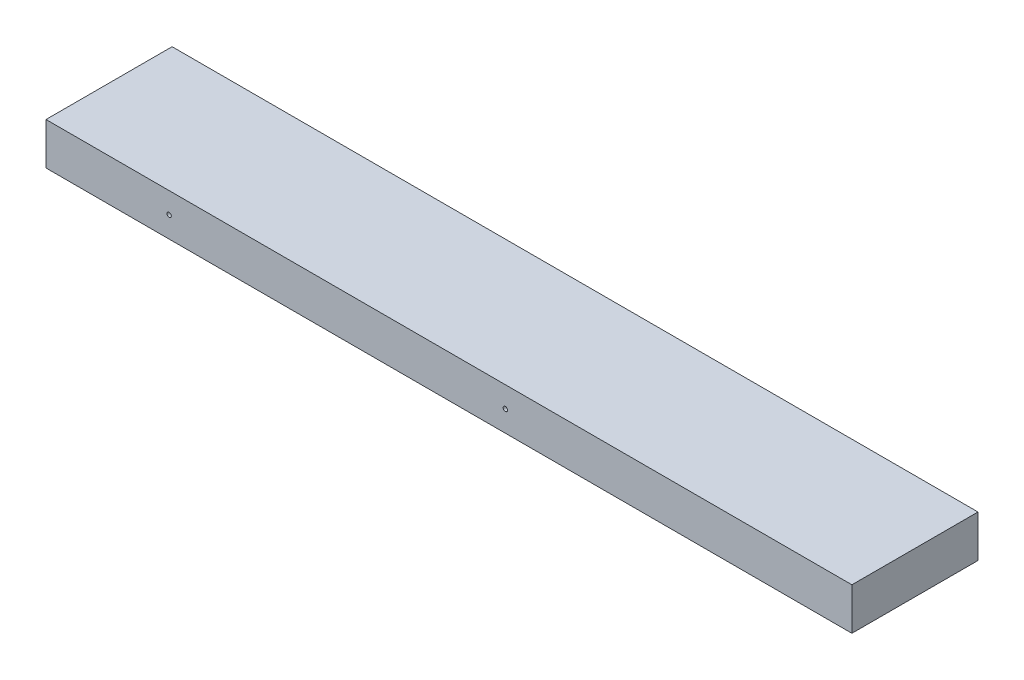
ISO-10303-21;
HEADER;
FILE_DESCRIPTION(('STEP AP214'),'2;1');
FILE_NAME('part.step','',(''),(''),'','','');
FILE_SCHEMA(('AUTOMOTIVE_DESIGN { 1 0 10303 214 1 1 1 1 }'));
ENDSEC;
DATA;
#1=APPLICATION_CONTEXT('core data for automotive mechanical design processes');
#2=APPLICATION_PROTOCOL_DEFINITION('international standard','automotive_design',2000,#1);
#3=PRODUCT_CONTEXT('',#1,'mechanical');
#4=PRODUCT('Part','Part','',(#3));
#5=PRODUCT_RELATED_PRODUCT_CATEGORY('part','',(#4));
#6=PRODUCT_DEFINITION_FORMATION('','',#4);
#7=PRODUCT_DEFINITION_CONTEXT('part definition',#1,'design');
#8=PRODUCT_DEFINITION('design','',#6,#7);
#9=PRODUCT_DEFINITION_SHAPE('','',#8);
#10=(LENGTH_UNIT() NAMED_UNIT(*) SI_UNIT(.MILLI.,.METRE.));
#11=(NAMED_UNIT(*) PLANE_ANGLE_UNIT() SI_UNIT($,.RADIAN.));
#12=(NAMED_UNIT(*) SI_UNIT($,.STERADIAN.) SOLID_ANGLE_UNIT());
#13=UNCERTAINTY_MEASURE_WITH_UNIT(LENGTH_MEASURE(1.E-05),#10,'distance_accuracy_value','');
#14=(GEOMETRIC_REPRESENTATION_CONTEXT(3) GLOBAL_UNCERTAINTY_ASSIGNED_CONTEXT((#13)) GLOBAL_UNIT_ASSIGNED_CONTEXT((#10,
#11,#12)) REPRESENTATION_CONTEXT('',''));
#15=CARTESIAN_POINT('',(0.,0.,0.));
#16=DIRECTION('',(0.,0.,1.));
#17=DIRECTION('',(1.,0.,0.));
#18=AXIS2_PLACEMENT_3D('',#15,#16,#17);
#19=CARTESIAN_POINT('',(86.3599999999997,5213.35,2683.51));
#20=DIRECTION('',(0.,-1.,0.));
#21=DIRECTION('',(0.,0.,-1.));
#22=AXIS2_PLACEMENT_3D('',#19,#20,#21);
#23=PLANE('',#22);
#24=DIRECTION('',(1.,0.,0.));
#25=VECTOR('',#24,1.);
#26=CARTESIAN_POINT('',(265.815570864871,5213.35,2683.51));
#27=LINE('',#26,#25);
#28=CARTESIAN_POINT('',(80.0100000000007,5213.35,2683.51));
#29=VERTEX_POINT('',#28);
#30=CARTESIAN_POINT('',(445.271141729743,5213.35000000001,2683.51));
#31=VERTEX_POINT('',#30);
#32=EDGE_CURVE('E71',#29,#31,#27,.T.);
#33=ORIENTED_EDGE('',*,*,#32,.T.);
#34=DIRECTION('',(0.,0.,-1.));
#35=VECTOR('',#34,1.);
#36=CARTESIAN_POINT('',(445.271141729743,5213.35000000001,2683.51));
#37=LINE('',#36,#35);
#38=CARTESIAN_POINT('',(445.271141729743,5213.35,2740.66));
#39=VERTEX_POINT('',#38);
#40=EDGE_CURVE('E146',#39,#31,#37,.T.);
#41=ORIENTED_EDGE('',*,*,#40,.F.);
#42=DIRECTION('',(-1.,0.,0.));
#43=VECTOR('',#42,1.);
#44=CARTESIAN_POINT('',(265.815570864871,5213.35,2740.66));
#45=LINE('',#44,#43);
#46=CARTESIAN_POINT('',(80.0099999999994,5213.35,2740.66));
#47=VERTEX_POINT('',#46);
#48=EDGE_CURVE('E76',#39,#47,#45,.T.);
#49=ORIENTED_EDGE('',*,*,#48,.T.);
#50=DIRECTION('',(0.,0.,1.));
#51=VECTOR('',#50,1.);
#52=CARTESIAN_POINT('',(80.0100000000007,5213.35,2683.51));
#53=LINE('',#52,#51);
#54=EDGE_CURVE('E137',#29,#47,#53,.T.);
#55=ORIENTED_EDGE('',*,*,#54,.F.);
#56=EDGE_LOOP('',(#33,#41,#49,#55));
#57=FACE_BOUND('',#56,.T.);
#58=ADVANCED_FACE('F40',(#57),#23,.T.);
#59=CARTESIAN_POINT('',(265.815570864873,5222.875,2740.66));
#60=DIRECTION('',(0.,0.,-1.));
#61=DIRECTION('',(-1.,0.,0.));
#62=AXIS2_PLACEMENT_3D('',#59,#60,#61);
#63=PLANE('',#62);
#64=CARTESIAN_POINT('',(135.802759022742,5222.875,2740.66));
#65=DIRECTION('',(0.,0.,-1.));
#66=DIRECTION('',(-1.,0.,0.));
#67=AXIS2_PLACEMENT_3D('',#64,#65,#66);
#68=CIRCLE('',#67,0.991870000000006);
#69=CARTESIAN_POINT('',(134.810889022742,5222.875,2740.66));
#70=VERTEX_POINT('',#69);
#71=EDGE_CURVE('E43',#70,#70,#68,.T.);
#72=ORIENTED_EDGE('',*,*,#71,.T.);
#73=EDGE_LOOP('',(#72));
#74=FACE_BOUND('',#73,.T.);
#75=CARTESIAN_POINT('',(288.202759022741,5222.87500000001,2740.66));
#76=DIRECTION('',(0.,0.,-1.));
#77=DIRECTION('',(-1.,0.,0.));
#78=AXIS2_PLACEMENT_3D('',#75,#76,#77);
#79=CIRCLE('',#78,0.991870000000006);
#80=CARTESIAN_POINT('',(287.210889022741,5222.87500000001,2740.66));
#81=VERTEX_POINT('',#80);
#82=EDGE_CURVE('E118',#81,#81,#79,.T.);
#83=ORIENTED_EDGE('',*,*,#82,.T.);
#84=EDGE_LOOP('',(#83));
#85=FACE_BOUND('',#84,.T.);
#86=DIRECTION('',(1.,0.,0.));
#87=VECTOR('',#86,1.);
#88=CARTESIAN_POINT('',(445.271141729742,5232.40000000001,2740.66));
#89=LINE('',#88,#87);
#90=CARTESIAN_POINT('',(80.0100000000003,5232.4,2740.66));
#91=VERTEX_POINT('',#90);
#92=CARTESIAN_POINT('',(445.271141729742,5232.40000000001,2740.66));
#93=VERTEX_POINT('',#92);
#94=EDGE_CURVE('E80',#91,#93,#89,.T.);
#95=ORIENTED_EDGE('',*,*,#94,.F.);
#96=DIRECTION('',(0.,1.,0.));
#97=VECTOR('',#96,1.);
#98=CARTESIAN_POINT('',(80.0099999999994,5213.35,2740.66));
#99=LINE('',#98,#97);
#100=EDGE_CURVE('E139',#47,#91,#99,.T.);
#101=ORIENTED_EDGE('',*,*,#100,.F.);
#102=ORIENTED_EDGE('',*,*,#48,.F.);
#103=DIRECTION('',(0.,1.,0.));
#104=VECTOR('',#103,1.);
#105=CARTESIAN_POINT('',(445.271141729743,5213.35,2740.66));
#106=LINE('',#105,#104);
#107=EDGE_CURVE('E148',#93,#39,#106,.F.);
#108=ORIENTED_EDGE('',*,*,#107,.F.);
#109=EDGE_LOOP('',(#95,#101,#102,#108));
#110=FACE_BOUND('',#109,.T.);
#111=ADVANCED_FACE('F160',(#74,#85,#110),#63,.F.);
#112=CARTESIAN_POINT('',(445.271141729743,5213.35000000001,2683.51));
#113=DIRECTION('',(1.,0.,0.));
#114=DIRECTION('',(0.,0.,-1.));
#115=AXIS2_PLACEMENT_3D('',#112,#113,#114);
#116=PLANE('',#115);
#117=DIRECTION('',(0.,1.,0.));
#118=VECTOR('',#117,1.);
#119=CARTESIAN_POINT('',(445.271141729744,5222.875,2683.51));
#120=LINE('',#119,#118);
#121=CARTESIAN_POINT('',(445.271141729743,5232.40000000001,2683.51));
#122=VERTEX_POINT('',#121);
#123=EDGE_CURVE('E58',#31,#122,#120,.T.);
#124=ORIENTED_EDGE('',*,*,#123,.T.);
#125=DIRECTION('',(0.,0.,1.));
#126=VECTOR('',#125,1.);
#127=CARTESIAN_POINT('',(445.271141729743,5232.40000000001,2683.51));
#128=LINE('',#127,#126);
#129=EDGE_CURVE('E49',#93,#122,#128,.F.);
#130=ORIENTED_EDGE('',*,*,#129,.F.);
#131=ORIENTED_EDGE('',*,*,#107,.T.);
#132=ORIENTED_EDGE('',*,*,#40,.T.);
#133=EDGE_LOOP('',(#124,#130,#131,#132));
#134=FACE_BOUND('',#133,.T.);
#135=ADVANCED_FACE('F191',(#134),#116,.T.);
#136=CARTESIAN_POINT('',(265.815570864873,5222.87500000001,2683.51));
#137=DIRECTION('',(0.,0.,1.));
#138=DIRECTION('',(1.,0.,0.));
#139=AXIS2_PLACEMENT_3D('',#136,#137,#138);
#140=PLANE('',#139);
#141=CARTESIAN_POINT('',(415.202759022741,5222.87500000001,2683.51));
#142=DIRECTION('',(0.,0.,1.));
#143=DIRECTION('',(1.,0.,0.));
#144=AXIS2_PLACEMENT_3D('',#141,#142,#143);
#145=CIRCLE('',#144,0.991870000000006);
#146=CARTESIAN_POINT('',(416.194629022741,5222.87500000001,2683.51));
#147=VERTEX_POINT('',#146);
#148=EDGE_CURVE('E122',#147,#147,#145,.T.);
#149=ORIENTED_EDGE('',*,*,#148,.T.);
#150=EDGE_LOOP('',(#149));
#151=FACE_BOUND('',#150,.T.);
#152=CARTESIAN_POINT('',(313.602759022741,5222.87500000001,2683.51));
#153=DIRECTION('',(0.,0.,1.));
#154=DIRECTION('',(1.,0.,0.));
#155=AXIS2_PLACEMENT_3D('',#152,#153,#154);
#156=CIRCLE('',#155,0.991870000000006);
#157=CARTESIAN_POINT('',(314.594629022741,5222.87500000001,2683.51));
#158=VERTEX_POINT('',#157);
#159=EDGE_CURVE('E126',#158,#158,#156,.T.);
#160=ORIENTED_EDGE('',*,*,#159,.T.);
#161=EDGE_LOOP('',(#160));
#162=FACE_BOUND('',#161,.T.);
#163=CARTESIAN_POINT('',(110.402759022741,5222.87500000001,2683.51));
#164=DIRECTION('',(0.,0.,1.));
#165=DIRECTION('',(1.,0.,0.));
#166=AXIS2_PLACEMENT_3D('',#163,#164,#165);
#167=CIRCLE('',#166,0.991870000000006);
#168=CARTESIAN_POINT('',(111.394629022741,5222.87500000001,2683.51));
#169=VERTEX_POINT('',#168);
#170=EDGE_CURVE('E130',#169,#169,#167,.T.);
#171=ORIENTED_EDGE('',*,*,#170,.T.);
#172=EDGE_LOOP('',(#171));
#173=FACE_BOUND('',#172,.T.);
#174=ORIENTED_EDGE('',*,*,#123,.F.);
#175=ORIENTED_EDGE('',*,*,#32,.F.);
#176=DIRECTION('',(0.,-1.,0.));
#177=VECTOR('',#176,1.);
#178=CARTESIAN_POINT('',(80.0099999999999,5232.4,2683.51));
#179=LINE('',#178,#177);
#180=CARTESIAN_POINT('',(80.0099999999999,5232.4,2683.51));
#181=VERTEX_POINT('',#180);
#182=EDGE_CURVE('E134',#181,#29,#179,.T.);
#183=ORIENTED_EDGE('',*,*,#182,.F.);
#184=DIRECTION('',(1.,0.,0.));
#185=VECTOR('',#184,1.);
#186=CARTESIAN_POINT('',(445.271141729743,5232.40000000001,2683.51));
#187=LINE('',#186,#185);
#188=EDGE_CURVE('E11',#122,#181,#187,.F.);
#189=ORIENTED_EDGE('',*,*,#188,.F.);
#190=EDGE_LOOP('',(#174,#175,#183,#189));
#191=FACE_BOUND('',#190,.T.);
#192=ADVANCED_FACE('F181',(#151,#162,#173,#191),#140,.F.);
#193=CARTESIAN_POINT('',(445.271141729743,5232.40000000001,2683.51));
#194=DIRECTION('',(0.,1.,0.));
#195=DIRECTION('',(0.,0.,1.));
#196=AXIS2_PLACEMENT_3D('',#193,#194,#195);
#197=PLANE('',#196);
#198=ORIENTED_EDGE('',*,*,#188,.T.);
#199=DIRECTION('',(0.,0.,-1.));
#200=VECTOR('',#199,1.);
#201=CARTESIAN_POINT('',(80.0100000000003,5232.4,2740.66));
#202=LINE('',#201,#200);
#203=EDGE_CURVE('E131',#91,#181,#202,.T.);
#204=ORIENTED_EDGE('',*,*,#203,.F.);
#205=ORIENTED_EDGE('',*,*,#94,.T.);
#206=ORIENTED_EDGE('',*,*,#129,.T.);
#207=EDGE_LOOP('',(#198,#204,#205,#206));
#208=FACE_BOUND('',#207,.T.);
#209=ADVANCED_FACE('F178',(#208),#197,.T.);
#210=CARTESIAN_POINT('',(80.0099999999997,1.77635683940025E-12,0.));
#211=DIRECTION('',(-1.,0.,0.));
#212=DIRECTION('',(0.,0.,1.));
#213=AXIS2_PLACEMENT_3D('',#210,#211,#212);
#214=PLANE('',#213);
#215=ORIENTED_EDGE('',*,*,#203,.T.);
#216=ORIENTED_EDGE('',*,*,#182,.T.);
#217=ORIENTED_EDGE('',*,*,#54,.T.);
#218=ORIENTED_EDGE('',*,*,#100,.T.);
#219=EDGE_LOOP('',(#215,#216,#217,#218));
#220=FACE_BOUND('',#219,.T.);
#221=ADVANCED_FACE('F180',(#220),#214,.T.);
#222=CARTESIAN_POINT('',(110.402759022742,5222.87500000001,2664.46));
#223=DIRECTION('',(0.,0.,-1.));
#224=DIRECTION('',(-1.,0.,0.));
#225=AXIS2_PLACEMENT_3D('',#222,#223,#224);
#226=CYLINDRICAL_SURFACE('',#225,0.991870000000006);
#227=CARTESIAN_POINT('',(110.402759022741,5222.87500000001,2702.56));
#228=DIRECTION('',(0.,0.,-1.));
#229=DIRECTION('',(-1.,0.,0.));
#230=AXIS2_PLACEMENT_3D('',#227,#228,#229);
#231=CIRCLE('',#230,0.991870000000006);
#232=CARTESIAN_POINT('',(109.410889022741,5222.87500000001,2702.56));
#233=VERTEX_POINT('',#232);
#234=EDGE_CURVE('E127',#233,#233,#231,.T.);
#235=ORIENTED_EDGE('',*,*,#234,.F.);
#236=EDGE_LOOP('',(#235));
#237=FACE_BOUND('',#236,.T.);
#238=ORIENTED_EDGE('',*,*,#170,.F.);
#239=EDGE_LOOP('',(#238));
#240=FACE_BOUND('',#239,.T.);
#241=ADVANCED_FACE('F188',(#237,#240),#226,.F.);
#242=CARTESIAN_POINT('',(110.402759022741,5222.87500000001,2702.56));
#243=DIRECTION('',(0.,0.,-1.));
#244=DIRECTION('',(-1.,0.,0.));
#245=AXIS2_PLACEMENT_3D('',#242,#243,#244);
#246=CONICAL_SURFACE('',#245,0.991870000000006,1.02974425867677);
#247=CARTESIAN_POINT('',(110.402759022742,5222.875,2703.1559756222));
#248=VERTEX_POINT('',#247);
#249=VERTEX_LOOP('',#248);
#250=FACE_BOUND('',#249,.T.);
#251=ORIENTED_EDGE('',*,*,#234,.T.);
#252=EDGE_LOOP('',(#251));
#253=FACE_BOUND('',#252,.T.);
#254=ADVANCED_FACE('F257',(#250,#253),#246,.F.);
#255=CARTESIAN_POINT('',(313.602759022742,5222.87500000001,2664.46));
#256=DIRECTION('',(0.,0.,-1.));
#257=DIRECTION('',(-1.,0.,0.));
#258=AXIS2_PLACEMENT_3D('',#255,#256,#257);
#259=CYLINDRICAL_SURFACE('',#258,0.991870000000006);
#260=CARTESIAN_POINT('',(313.602759022742,5222.87500000001,2702.56));
#261=DIRECTION('',(0.,0.,-1.));
#262=DIRECTION('',(-1.,0.,0.));
#263=AXIS2_PLACEMENT_3D('',#260,#261,#262);
#264=CIRCLE('',#263,0.991870000000006);
#265=CARTESIAN_POINT('',(312.610889022742,5222.87500000001,2702.56));
#266=VERTEX_POINT('',#265);
#267=EDGE_CURVE('E123',#266,#266,#264,.T.);
#268=ORIENTED_EDGE('',*,*,#267,.F.);
#269=EDGE_LOOP('',(#268));
#270=FACE_BOUND('',#269,.T.);
#271=ORIENTED_EDGE('',*,*,#159,.F.);
#272=EDGE_LOOP('',(#271));
#273=FACE_BOUND('',#272,.T.);
#274=ADVANCED_FACE('F248',(#270,#273),#259,.F.);
#275=CARTESIAN_POINT('',(313.602759022742,5222.87500000001,2702.56));
#276=DIRECTION('',(0.,0.,-1.));
#277=DIRECTION('',(-1.,0.,0.));
#278=AXIS2_PLACEMENT_3D('',#275,#276,#277);
#279=CONICAL_SURFACE('',#278,0.991870000000006,1.02974425867677);
#280=CARTESIAN_POINT('',(313.602759022743,5222.875,2703.1559756222));
#281=VERTEX_POINT('',#280);
#282=VERTEX_LOOP('',#281);
#283=FACE_BOUND('',#282,.T.);
#284=ORIENTED_EDGE('',*,*,#267,.T.);
#285=EDGE_LOOP('',(#284));
#286=FACE_BOUND('',#285,.T.);
#287=ADVANCED_FACE('F239',(#283,#286),#279,.F.);
#288=CARTESIAN_POINT('',(415.202759022742,5222.87500000001,2664.46));
#289=DIRECTION('',(0.,0.,-1.));
#290=DIRECTION('',(-1.,0.,0.));
#291=AXIS2_PLACEMENT_3D('',#288,#289,#290);
#292=CYLINDRICAL_SURFACE('',#291,0.991870000000006);
#293=CARTESIAN_POINT('',(415.202759022741,5222.87500000001,2702.56));
#294=DIRECTION('',(0.,0.,-1.));
#295=DIRECTION('',(-1.,0.,0.));
#296=AXIS2_PLACEMENT_3D('',#293,#294,#295);
#297=CIRCLE('',#296,0.991870000000006);
#298=CARTESIAN_POINT('',(414.210889022741,5222.87500000001,2702.56));
#299=VERTEX_POINT('',#298);
#300=EDGE_CURVE('E119',#299,#299,#297,.T.);
#301=ORIENTED_EDGE('',*,*,#300,.F.);
#302=EDGE_LOOP('',(#301));
#303=FACE_BOUND('',#302,.T.);
#304=ORIENTED_EDGE('',*,*,#148,.F.);
#305=EDGE_LOOP('',(#304));
#306=FACE_BOUND('',#305,.T.);
#307=ADVANCED_FACE('F174',(#303,#306),#292,.F.);
#308=CARTESIAN_POINT('',(415.202759022741,5222.87500000001,2702.56));
#309=DIRECTION('',(0.,0.,-1.));
#310=DIRECTION('',(-1.,0.,0.));
#311=AXIS2_PLACEMENT_3D('',#308,#309,#310);
#312=CONICAL_SURFACE('',#311,0.991870000000006,1.02974425867677);
#313=CARTESIAN_POINT('',(415.202759022742,5222.875,2703.1559756222));
#314=VERTEX_POINT('',#313);
#315=VERTEX_LOOP('',#314);
#316=FACE_BOUND('',#315,.T.);
#317=ORIENTED_EDGE('',*,*,#300,.T.);
#318=EDGE_LOOP('',(#317));
#319=FACE_BOUND('',#318,.T.);
#320=ADVANCED_FACE('F165',(#316,#319),#312,.F.);
#321=CARTESIAN_POINT('',(288.202759022741,5222.87500000001,2759.71000000001));
#322=DIRECTION('',(0.,0.,1.));
#323=DIRECTION('',(1.,0.,0.));
#324=AXIS2_PLACEMENT_3D('',#321,#322,#323);
#325=CYLINDRICAL_SURFACE('',#324,0.991870000000006);
#326=CARTESIAN_POINT('',(288.202759022741,5222.87500000001,2721.61000000001));
#327=DIRECTION('',(0.,0.,1.));
#328=DIRECTION('',(1.,0.,0.));
#329=AXIS2_PLACEMENT_3D('',#326,#327,#328);
#330=CIRCLE('',#329,0.991870000000006);
#331=CARTESIAN_POINT('',(289.194629022741,5222.87500000001,2721.61000000001));
#332=VERTEX_POINT('',#331);
#333=EDGE_CURVE('E114',#332,#332,#330,.T.);
#334=ORIENTED_EDGE('',*,*,#333,.F.);
#335=EDGE_LOOP('',(#334));
#336=FACE_BOUND('',#335,.T.);
#337=ORIENTED_EDGE('',*,*,#82,.F.);
#338=EDGE_LOOP('',(#337));
#339=FACE_BOUND('',#338,.T.);
#340=ADVANCED_FACE('F162',(#336,#339),#325,.F.);
#341=CARTESIAN_POINT('',(288.202759022741,5222.87500000001,2721.61000000001));
#342=DIRECTION('',(0.,0.,1.));
#343=DIRECTION('',(1.,0.,0.));
#344=AXIS2_PLACEMENT_3D('',#341,#342,#343);
#345=CONICAL_SURFACE('',#344,0.991870000000006,1.02974425867677);
#346=CARTESIAN_POINT('',(288.202759022741,5222.87500000001,2721.01402437781));
#347=VERTEX_POINT('',#346);
#348=VERTEX_LOOP('',#347);
#349=FACE_BOUND('',#348,.T.);
#350=ORIENTED_EDGE('',*,*,#333,.T.);
#351=EDGE_LOOP('',(#350));
#352=FACE_BOUND('',#351,.T.);
#353=ADVANCED_FACE('F164',(#349,#352),#345,.F.);
#354=CARTESIAN_POINT('',(135.802759022741,5222.875,2759.71000000001));
#355=DIRECTION('',(0.,0.,1.));
#356=DIRECTION('',(1.,0.,0.));
#357=AXIS2_PLACEMENT_3D('',#354,#355,#356);
#358=CYLINDRICAL_SURFACE('',#357,0.991870000000006);
#359=CARTESIAN_POINT('',(135.802759022741,5222.875,2721.61000000001));
#360=DIRECTION('',(0.,0.,1.));
#361=DIRECTION('',(1.,0.,0.));
#362=AXIS2_PLACEMENT_3D('',#359,#360,#361);
#363=CIRCLE('',#362,0.991870000000006);
#364=CARTESIAN_POINT('',(136.794629022741,5222.875,2721.61000000001));
#365=VERTEX_POINT('',#364);
#366=EDGE_CURVE('E110',#365,#365,#363,.T.);
#367=ORIENTED_EDGE('',*,*,#366,.F.);
#368=EDGE_LOOP('',(#367));
#369=FACE_BOUND('',#368,.T.);
#370=ORIENTED_EDGE('',*,*,#71,.F.);
#371=EDGE_LOOP('',(#370));
#372=FACE_BOUND('',#371,.T.);
#373=ADVANCED_FACE('F106',(#369,#372),#358,.F.);
#374=CARTESIAN_POINT('',(135.802759022741,5222.875,2721.61000000001));
#375=DIRECTION('',(0.,0.,1.));
#376=DIRECTION('',(1.,0.,0.));
#377=AXIS2_PLACEMENT_3D('',#374,#375,#376);
#378=CONICAL_SURFACE('',#377,0.991870000000006,1.02974425867677);
#379=CARTESIAN_POINT('',(135.802759022741,5222.87500000001,2721.01402437781));
#380=VERTEX_POINT('',#379);
#381=VERTEX_LOOP('',#380);
#382=FACE_BOUND('',#381,.T.);
#383=ORIENTED_EDGE('',*,*,#366,.T.);
#384=EDGE_LOOP('',(#383));
#385=FACE_BOUND('',#384,.T.);
#386=ADVANCED_FACE('F103',(#382,#385),#378,.F.);
#387=CLOSED_SHELL('',(#58,#111,#135,#192,#209,#221,#241,#254,#274,#287,#307,#320,#340,#353,#373,#386));
#388=MANIFOLD_SOLID_BREP('B2',#387);
#389=ADVANCED_BREP_SHAPE_REPRESENTATION('',(#18,#388),#14);
#390=SHAPE_DEFINITION_REPRESENTATION(#9,#389);
ENDSEC;
END-ISO-10303-21;
